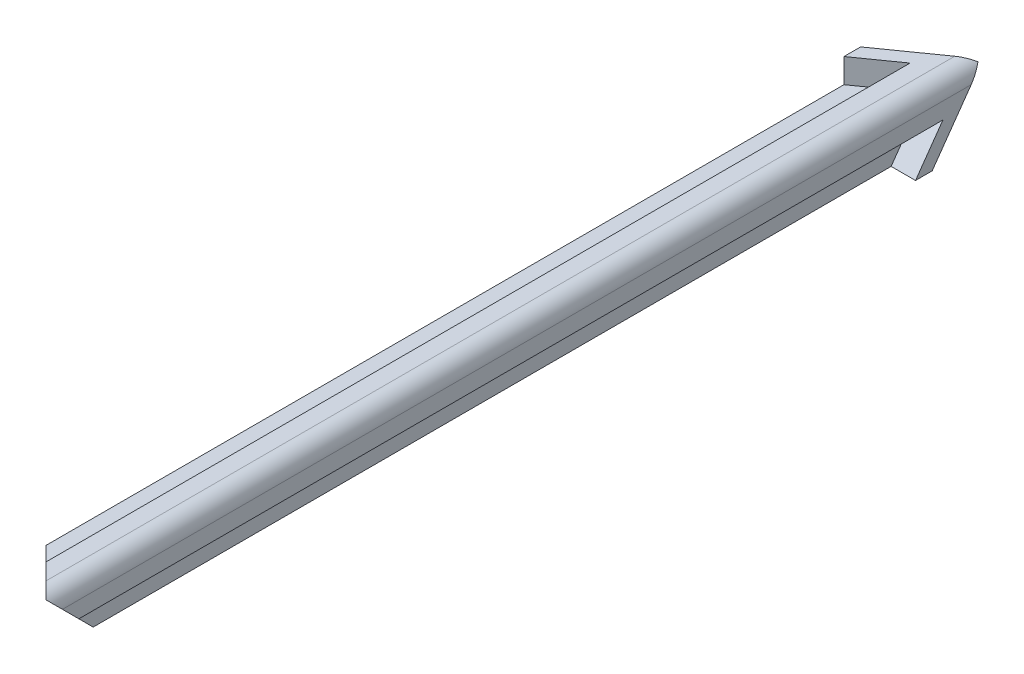
ISO-10303-21;
HEADER;
FILE_DESCRIPTION(('STEP AP214'),'2;1');
FILE_NAME('part.step','',(''),(''),'','','');
FILE_SCHEMA(('AUTOMOTIVE_DESIGN { 1 0 10303 214 1 1 1 1 }'));
ENDSEC;
DATA;
#1=APPLICATION_CONTEXT('core data for automotive mechanical design processes');
#2=APPLICATION_PROTOCOL_DEFINITION('international standard','automotive_design',2000,#1);
#3=PRODUCT_CONTEXT('',#1,'mechanical');
#4=PRODUCT('Part','Part','',(#3));
#5=PRODUCT_RELATED_PRODUCT_CATEGORY('part','',(#4));
#6=PRODUCT_DEFINITION_FORMATION('','',#4);
#7=PRODUCT_DEFINITION_CONTEXT('part definition',#1,'design');
#8=PRODUCT_DEFINITION('design','',#6,#7);
#9=PRODUCT_DEFINITION_SHAPE('','',#8);
#10=(LENGTH_UNIT() NAMED_UNIT(*) SI_UNIT(.MILLI.,.METRE.));
#11=(NAMED_UNIT(*) PLANE_ANGLE_UNIT() SI_UNIT($,.RADIAN.));
#12=(NAMED_UNIT(*) SI_UNIT($,.STERADIAN.) SOLID_ANGLE_UNIT());
#13=UNCERTAINTY_MEASURE_WITH_UNIT(LENGTH_MEASURE(1.E-05),#10,'distance_accuracy_value','');
#14=(GEOMETRIC_REPRESENTATION_CONTEXT(3) GLOBAL_UNCERTAINTY_ASSIGNED_CONTEXT((#13)) GLOBAL_UNIT_ASSIGNED_CONTEXT((#10,
#11,#12)) REPRESENTATION_CONTEXT('',''));
#15=CARTESIAN_POINT('',(0.,0.,0.));
#16=DIRECTION('',(0.,0.,1.));
#17=DIRECTION('',(1.,0.,0.));
#18=AXIS2_PLACEMENT_3D('',#15,#16,#17);
#19=CARTESIAN_POINT('',(-1.50000004800001,-2.53999999999999,130.175));
#20=DIRECTION('',(-1.,0.,0.));
#21=DIRECTION('',(0.,-1.,0.));
#22=AXIS2_PLACEMENT_3D('',#19,#20,#21);
#23=PLANE('',#22);
#24=DIRECTION('',(0.,-0.816496580927727,0.577350269189625));
#25=VECTOR('',#24,1.);
#26=CARTESIAN_POINT('',(-1.50000004800001,-2.53999999999999,4.90690319754844));
#27=LINE('',#26,#25);
#28=CARTESIAN_POINT('',(-1.50000004800001,-2.53999999999999,4.90690319754844));
#29=VERTEX_POINT('',#28);
#30=CARTESIAN_POINT('',(-1.50000004800003,-7.30249999999999,8.27449924294935));
#31=VERTEX_POINT('',#30);
#32=EDGE_CURVE('E189',#29,#31,#27,.T.);
#33=ORIENTED_EDGE('',*,*,#32,.F.);
#34=DIRECTION('',(0.,0.,-1.));
#35=VECTOR('',#34,1.);
#36=CARTESIAN_POINT('',(-1.50000004800001,-2.53999999999999,130.175));
#37=LINE('',#36,#35);
#38=CARTESIAN_POINT('',(-1.50000004800001,-2.53999999999999,111.164878));
#39=VERTEX_POINT('',#38);
#40=EDGE_CURVE('E182',#39,#29,#37,.T.);
#41=ORIENTED_EDGE('',*,*,#40,.F.);
#42=DIRECTION('',(0.,-0.707106781186548,-0.707106781186547));
#43=VECTOR('',#42,1.);
#44=CARTESIAN_POINT('',(-1.50000004799998,6.96506099999999,120.669939));
#45=LINE('',#44,#43);
#46=CARTESIAN_POINT('',(-1.50000004800003,-7.30249999999999,106.402378));
#47=VERTEX_POINT('',#46);
#48=EDGE_CURVE('E290',#39,#47,#45,.T.);
#49=ORIENTED_EDGE('',*,*,#48,.T.);
#50=DIRECTION('',(0.,0.,-1.));
#51=VECTOR('',#50,1.);
#52=CARTESIAN_POINT('',(-1.50000004800003,-7.30249999999999,130.175));
#53=LINE('',#52,#51);
#54=EDGE_CURVE('E58',#47,#31,#53,.T.);
#55=ORIENTED_EDGE('',*,*,#54,.T.);
#56=EDGE_LOOP('',(#33,#41,#49,#55));
#57=FACE_BOUND('',#56,.T.);
#58=ADVANCED_FACE('F39',(#57),#23,.F.);
#59=CARTESIAN_POINT('',(-1.50000004800001,-2.53999999999999,130.175));
#60=DIRECTION('',(0.,1.,0.));
#61=DIRECTION('',(-1.,0.,0.));
#62=AXIS2_PLACEMENT_3D('',#59,#60,#61);
#63=PLANE('',#62);
#64=DIRECTION('',(-1.,0.,0.));
#65=VECTOR('',#64,1.);
#66=CARTESIAN_POINT('',(-1.50000004800001,-2.53999999999999,4.90690319754844));
#67=LINE('',#66,#65);
#68=CARTESIAN_POINT('',(1.50000004799999,-2.54,4.90690319754844));
#69=VERTEX_POINT('',#68);
#70=EDGE_CURVE('E69',#69,#29,#67,.T.);
#71=ORIENTED_EDGE('',*,*,#70,.F.);
#72=DIRECTION('',(0.,0.,-1.));
#73=VECTOR('',#72,1.);
#74=CARTESIAN_POINT('',(1.50000004799999,-2.54,130.175));
#75=LINE('',#74,#73);
#76=CARTESIAN_POINT('',(1.50000004799999,-2.54,111.164878));
#77=VERTEX_POINT('',#76);
#78=EDGE_CURVE('E311',#77,#69,#75,.T.);
#79=ORIENTED_EDGE('',*,*,#78,.F.);
#80=DIRECTION('',(-1.,0.,0.));
#81=VECTOR('',#80,1.);
#82=CARTESIAN_POINT('',(-1.50000004800003,-2.53999999999999,111.164878));
#83=LINE('',#82,#81);
#84=EDGE_CURVE('E184',#77,#39,#83,.T.);
#85=ORIENTED_EDGE('',*,*,#84,.T.);
#86=ORIENTED_EDGE('',*,*,#40,.T.);
#87=EDGE_LOOP('',(#71,#79,#85,#86));
#88=FACE_BOUND('',#87,.T.);
#89=ADVANCED_FACE('F183',(#88),#63,.F.);
#90=CARTESIAN_POINT('',(-7.3025,-1.500000048,130.175));
#91=DIRECTION('',(0.,-1.,0.));
#92=DIRECTION('',(1.,0.,0.));
#93=AXIS2_PLACEMENT_3D('',#90,#91,#92);
#94=PLANE('',#93);
#95=DIRECTION('',(0.816496580927726,0.,-0.577350269189625));
#96=VECTOR('',#95,1.);
#97=CARTESIAN_POINT('',(-7.30249999999999,-1.500000048,8.27449924294937));
#98=LINE('',#97,#96);
#99=CARTESIAN_POINT('',(-7.3025,-1.500000048,8.27449924294937));
#100=VERTEX_POINT('',#99);
#101=CARTESIAN_POINT('',(-2.54,-1.500000048,4.90690319754844));
#102=VERTEX_POINT('',#101);
#103=EDGE_CURVE('E210',#100,#102,#98,.T.);
#104=ORIENTED_EDGE('',*,*,#103,.F.);
#105=DIRECTION('',(0.,0.,-1.));
#106=VECTOR('',#105,1.);
#107=CARTESIAN_POINT('',(-7.3025,-1.500000048,130.175));
#108=LINE('',#107,#106);
#109=CARTESIAN_POINT('',(-7.3025,-1.500000048,106.402378));
#110=VERTEX_POINT('',#109);
#111=EDGE_CURVE('E330',#110,#100,#108,.T.);
#112=ORIENTED_EDGE('',*,*,#111,.F.);
#113=DIRECTION('',(0.707106781186548,0.,0.707106781186547));
#114=VECTOR('',#113,1.);
#115=CARTESIAN_POINT('',(4.58381100000001,-1.500000048,118.288689));
#116=LINE('',#115,#114);
#117=CARTESIAN_POINT('',(-2.54,-1.500000048,111.164878));
#118=VERTEX_POINT('',#117);
#119=EDGE_CURVE('E266',#110,#118,#116,.T.);
#120=ORIENTED_EDGE('',*,*,#119,.T.);
#121=DIRECTION('',(0.,0.,-1.));
#122=VECTOR('',#121,1.);
#123=CARTESIAN_POINT('',(-2.54,-1.500000048,130.175));
#124=LINE('',#123,#122);
#125=EDGE_CURVE('E334',#118,#102,#124,.T.);
#126=ORIENTED_EDGE('',*,*,#125,.T.);
#127=EDGE_LOOP('',(#104,#112,#120,#126));
#128=FACE_BOUND('',#127,.T.);
#129=ADVANCED_FACE('F398',(#128),#94,.F.);
#130=CARTESIAN_POINT('',(-2.54,1.500000048,130.175));
#131=DIRECTION('',(1.,0.,0.));
#132=DIRECTION('',(0.,0.,-1.));
#133=AXIS2_PLACEMENT_3D('',#130,#131,#132);
#134=PLANE('',#133);
#135=DIRECTION('',(0.,1.,0.));
#136=VECTOR('',#135,1.);
#137=CARTESIAN_POINT('',(-2.54,1.49999999999995,4.90690319754843));
#138=LINE('',#137,#136);
#139=CARTESIAN_POINT('',(-2.54,1.49999999999995,4.90690319754843));
#140=VERTEX_POINT('',#139);
#141=EDGE_CURVE('E214',#102,#140,#138,.T.);
#142=ORIENTED_EDGE('',*,*,#141,.F.);
#143=ORIENTED_EDGE('',*,*,#125,.F.);
#144=DIRECTION('',(0.,1.,0.));
#145=VECTOR('',#144,1.);
#146=CARTESIAN_POINT('',(-2.54,1.50000004799998,111.164878));
#147=LINE('',#146,#145);
#148=CARTESIAN_POINT('',(-2.54,1.500000048,111.164878));
#149=VERTEX_POINT('',#148);
#150=EDGE_CURVE('E270',#118,#149,#147,.T.);
#151=ORIENTED_EDGE('',*,*,#150,.T.);
#152=DIRECTION('',(0.,0.,-1.));
#153=VECTOR('',#152,1.);
#154=CARTESIAN_POINT('',(-2.54,1.500000048,130.175));
#155=LINE('',#154,#153);
#156=EDGE_CURVE('E186',#149,#140,#155,.T.);
#157=ORIENTED_EDGE('',*,*,#156,.T.);
#158=EDGE_LOOP('',(#142,#143,#151,#157));
#159=FACE_BOUND('',#158,.T.);
#160=ADVANCED_FACE('F403',(#159),#134,.F.);
#161=CARTESIAN_POINT('',(-7.3025,-3.621225168,130.175));
#162=DIRECTION('',(0.,1.,0.));
#163=DIRECTION('',(0.,0.,1.));
#164=AXIS2_PLACEMENT_3D('',#161,#162,#163);
#165=PLANE('',#164);
#166=DIRECTION('',(-0.816496580927726,0.,0.577350269189625));
#167=VECTOR('',#166,1.);
#168=CARTESIAN_POINT('',(-67.4404918833059,-3.621225168,45.1270362647456));
#169=LINE('',#168,#167);
#170=CARTESIAN_POINT('',(-5.8662891982673,-3.62122516800001,1.58749999999995));
#171=VERTEX_POINT('',#170);
#172=CARTESIAN_POINT('',(-7.3025,-3.621225168,2.60305439711853));
#173=VERTEX_POINT('',#172);
#174=EDGE_CURVE('E243',#171,#173,#169,.T.);
#175=ORIENTED_EDGE('',*,*,#174,.F.);
#176=DIRECTION('',(0.,0.,-1.));
#177=VECTOR('',#176,1.);
#178=CARTESIAN_POINT('',(-5.8662891982673,-3.621225168,130.175));
#179=LINE('',#178,#177);
#180=CARTESIAN_POINT('',(-5.8662891982673,-3.621225168,107.838588801733));
#181=VERTEX_POINT('',#180);
#182=EDGE_CURVE('E318',#181,#171,#179,.T.);
#183=ORIENTED_EDGE('',*,*,#182,.F.);
#184=DIRECTION('',(-0.707106781186548,0.,-0.707106781186547));
#185=VECTOR('',#184,1.);
#186=CARTESIAN_POINT('',(4.58381100000001,-3.621225168,118.288689));
#187=LINE('',#186,#185);
#188=CARTESIAN_POINT('',(-7.3025,-3.621225168,106.402378));
#189=VERTEX_POINT('',#188);
#190=EDGE_CURVE('E258',#181,#189,#187,.T.);
#191=ORIENTED_EDGE('',*,*,#190,.T.);
#192=DIRECTION('',(0.,0.,-1.));
#193=VECTOR('',#192,1.);
#194=CARTESIAN_POINT('',(-7.3025,-3.621225168,130.175));
#195=LINE('',#194,#193);
#196=EDGE_CURVE('E338',#189,#173,#195,.T.);
#197=ORIENTED_EDGE('',*,*,#196,.T.);
#198=EDGE_LOOP('',(#175,#183,#191,#197));
#199=FACE_BOUND('',#198,.T.);
#200=ADVANCED_FACE('F366',(#199),#165,.F.);
#201=CARTESIAN_POINT('',(-3.62122516800001,-2.53999999999999,130.175));
#202=DIRECTION('',(1.,0.,0.));
#203=DIRECTION('',(0.,1.,0.));
#204=AXIS2_PLACEMENT_3D('',#201,#202,#203);
#205=PLANE('',#204);
#206=DIRECTION('',(0.,0.816496580927727,-0.577350269189625));
#207=VECTOR('',#206,1.);
#208=CARTESIAN_POINT('',(-3.62122516800022,-64.2654918833058,42.8819722344782));
#209=LINE('',#208,#207);
#210=CARTESIAN_POINT('',(-3.62122516800002,-7.30249999999998,2.60305439711855));
#211=VERTEX_POINT('',#210);
#212=CARTESIAN_POINT('',(-3.62122516800002,-5.86628919826728,1.58749999999998));
#213=VERTEX_POINT('',#212);
#214=EDGE_CURVE('E232',#211,#213,#209,.T.);
#215=ORIENTED_EDGE('',*,*,#214,.F.);
#216=DIRECTION('',(0.,0.,-1.));
#217=VECTOR('',#216,1.);
#218=CARTESIAN_POINT('',(-3.62122516800002,-7.30249999999999,130.175));
#219=LINE('',#218,#217);
#220=CARTESIAN_POINT('',(-3.62122516800002,-7.30249999999999,106.402378));
#221=VERTEX_POINT('',#220);
#222=EDGE_CURVE('E326',#221,#211,#219,.T.);
#223=ORIENTED_EDGE('',*,*,#222,.F.);
#224=DIRECTION('',(0.,0.707106781186548,0.707106781186547));
#225=VECTOR('',#224,1.);
#226=CARTESIAN_POINT('',(-3.62122516799998,6.96506099999999,120.669939));
#227=LINE('',#226,#225);
#228=CARTESIAN_POINT('',(-3.62122516800001,-5.86628919826729,107.838588801733));
#229=VERTEX_POINT('',#228);
#230=EDGE_CURVE('E282',#221,#229,#227,.T.);
#231=ORIENTED_EDGE('',*,*,#230,.T.);
#232=DIRECTION('',(0.,0.,-1.));
#233=VECTOR('',#232,1.);
#234=CARTESIAN_POINT('',(-3.62122516800001,-5.86628919826729,130.175));
#235=LINE('',#234,#233);
#236=EDGE_CURVE('E314',#229,#213,#235,.T.);
#237=ORIENTED_EDGE('',*,*,#236,.T.);
#238=EDGE_LOOP('',(#215,#223,#231,#237));
#239=FACE_BOUND('',#238,.T.);
#240=ADVANCED_FACE('F390',(#239),#205,.F.);
#241=CARTESIAN_POINT('',(-7.3025,-1.500000048,130.175));
#242=DIRECTION('',(1.,0.,0.));
#243=DIRECTION('',(0.,0.,-1.));
#244=AXIS2_PLACEMENT_3D('',#241,#242,#243);
#245=PLANE('',#244);
#246=DIRECTION('',(0.,0.816496580927726,0.577350269189626));
#247=VECTOR('',#246,1.);
#248=CARTESIAN_POINT('',(-7.3025,57.9309167953059,46.1269913759293));
#249=LINE('',#248,#247);
#250=CARTESIAN_POINT('',(-7.30249999999999,1.50000004800001,6.22430747533568));
#251=VERTEX_POINT('',#250);
#252=EDGE_CURVE('E246',#173,#251,#249,.T.);
#253=ORIENTED_EDGE('',*,*,#252,.F.);
#254=ORIENTED_EDGE('',*,*,#196,.F.);
#255=DIRECTION('',(0.,1.,0.));
#256=VECTOR('',#255,1.);
#257=CARTESIAN_POINT('',(-7.3025,-1.50000004800002,106.402378));
#258=LINE('',#257,#256);
#259=EDGE_CURVE('E262',#189,#110,#258,.T.);
#260=ORIENTED_EDGE('',*,*,#259,.T.);
#261=ORIENTED_EDGE('',*,*,#111,.T.);
#262=DIRECTION('',(0.,1.,0.));
#263=VECTOR('',#262,1.);
#264=CARTESIAN_POINT('',(-7.30249999999999,1.49999999999995,8.27449924294936));
#265=LINE('',#264,#263);
#266=CARTESIAN_POINT('',(-7.30249999999999,1.49999999999995,8.27449924294936));
#267=VERTEX_POINT('',#266);
#268=EDGE_CURVE('E209',#100,#267,#265,.T.);
#269=ORIENTED_EDGE('',*,*,#268,.T.);
#270=DIRECTION('',(0.,2.34124743921473E-08,-1.));
#271=VECTOR('',#270,1.);
#272=CARTESIAN_POINT('',(-7.30249999999999,1.50000004800001,6.22430747533568));
#273=LINE('',#272,#271);
#274=EDGE_CURVE('E215',#267,#251,#273,.T.);
#275=ORIENTED_EDGE('',*,*,#274,.T.);
#276=EDGE_LOOP('',(#253,#254,#260,#261,#269,#275));
#277=FACE_BOUND('',#276,.T.);
#278=ADVANCED_FACE('F41',(#277),#245,.F.);
#279=CARTESIAN_POINT('',(-1.50000004800003,-7.30249999999999,130.175));
#280=DIRECTION('',(0.,1.,0.));
#281=DIRECTION('',(-1.,0.,0.));
#282=AXIS2_PLACEMENT_3D('',#279,#280,#281);
#283=PLANE('',#282);
#284=DIRECTION('',(-0.816496580927726,0.,-0.577350269189626));
#285=VECTOR('',#284,1.);
#286=CARTESIAN_POINT('',(57.9309167953059,-7.30250000000019,46.1269913759292));
#287=LINE('',#286,#285);
#288=CARTESIAN_POINT('',(1.50000004799998,-7.30250000000001,6.22430747533571));
#289=VERTEX_POINT('',#288);
#290=EDGE_CURVE('E235',#289,#211,#287,.T.);
#291=ORIENTED_EDGE('',*,*,#290,.F.);
#292=DIRECTION('',(0.,0.,1.));
#293=VECTOR('',#292,1.);
#294=CARTESIAN_POINT('',(1.50000004799998,-7.30250000000001,8.27449924294937));
#295=LINE('',#294,#293);
#296=CARTESIAN_POINT('',(1.50000004799998,-7.30250000000001,8.27449924294937));
#297=VERTEX_POINT('',#296);
#298=EDGE_CURVE('E193',#289,#297,#295,.T.);
#299=ORIENTED_EDGE('',*,*,#298,.T.);
#300=DIRECTION('',(-1.,0.,0.));
#301=VECTOR('',#300,1.);
#302=CARTESIAN_POINT('',(-1.50000004800003,-7.3025,8.27449924294937));
#303=LINE('',#302,#301);
#304=EDGE_CURVE('E206',#297,#31,#303,.T.);
#305=ORIENTED_EDGE('',*,*,#304,.T.);
#306=ORIENTED_EDGE('',*,*,#54,.F.);
#307=DIRECTION('',(-1.,0.,0.));
#308=VECTOR('',#307,1.);
#309=CARTESIAN_POINT('',(-1.50000004800006,-7.30249999999999,106.402378));
#310=LINE('',#309,#308);
#311=EDGE_CURVE('E286',#47,#221,#310,.T.);
#312=ORIENTED_EDGE('',*,*,#311,.T.);
#313=ORIENTED_EDGE('',*,*,#222,.T.);
#314=EDGE_LOOP('',(#291,#299,#305,#306,#312,#313));
#315=FACE_BOUND('',#314,.T.);
#316=ADVANCED_FACE('F387',(#315),#283,.F.);
#317=CARTESIAN_POINT('',(-0.519999976000003,-0.519999975999996,130.175));
#318=DIRECTION('',(0.,0.,-1.));
#319=DIRECTION('',(-1.,0.,0.));
#320=AXIS2_PLACEMENT_3D('',#317,#318,#319);
#321=CYLINDRICAL_SURFACE('',#320,2.020000024);
#322=CARTESIAN_POINT('',(-0.519999976000003,-0.519999975999996,0.));
#323=DIRECTION('',(-0.499999999999999,0.500000000000001,-0.707106781186548));
#324=DIRECTION('',(0.5,-0.500000000000001,-0.707106781186548));
#325=AXIS2_PLACEMENT_3D('',#322,#323,#324);
#326=ELLIPSE('',#325,2.85671142993477,2.020000024);
#327=CARTESIAN_POINT('',(-0.519999975999996,1.500000048,1.42835571496734));
#328=VERTEX_POINT('',#327);
#329=CARTESIAN_POINT('',(0.90835573896739,0.908355738967382,0.));
#330=VERTEX_POINT('',#329);
#331=EDGE_CURVE('E252',#328,#330,#326,.T.);
#332=ORIENTED_EDGE('',*,*,#331,.F.);
#333=DIRECTION('',(0.,0.,-1.));
#334=VECTOR('',#333,1.);
#335=CARTESIAN_POINT('',(-0.519999976000003,1.500000048,130.175));
#336=LINE('',#335,#334);
#337=CARTESIAN_POINT('',(-0.519999976000003,1.500000048,113.184878024));
#338=VERTEX_POINT('',#337);
#339=EDGE_CURVE('E303',#338,#328,#336,.T.);
#340=ORIENTED_EDGE('',*,*,#339,.F.);
#341=CARTESIAN_POINT('',(-0.519999976000003,-0.519999975999996,113.184878024));
#342=DIRECTION('',(0.707106781186547,0.,-0.707106781186548));
#343=DIRECTION('',(-0.707106781186548,0.,-0.707106781186547));
#344=AXIS2_PLACEMENT_3D('',#341,#342,#343);
#345=ELLIPSE('',#344,2.85671142993477,2.020000024);
#346=CARTESIAN_POINT('',(0.908355738967413,0.908355738967354,114.613233738967));
#347=VERTEX_POINT('',#346);
#348=EDGE_CURVE('E278',#338,#347,#345,.T.);
#349=ORIENTED_EDGE('',*,*,#348,.T.);
#350=CARTESIAN_POINT('',(-0.519999976000003,-0.519999975999996,113.184878024));
#351=DIRECTION('',(0.,0.707106781186547,-0.707106781186548));
#352=DIRECTION('',(0.,-0.707106781186548,-0.707106781186547));
#353=AXIS2_PLACEMENT_3D('',#350,#351,#352);
#354=ELLIPSE('',#353,2.85671142993477,2.020000024);
#355=CARTESIAN_POINT('',(1.50000004799999,-0.519999975999995,113.184878024));
#356=VERTEX_POINT('',#355);
#357=EDGE_CURVE('E299',#347,#356,#354,.T.);
#358=ORIENTED_EDGE('',*,*,#357,.T.);
#359=DIRECTION('',(0.,0.,-1.));
#360=VECTOR('',#359,1.);
#361=CARTESIAN_POINT('',(1.50000004799999,-0.519999975999996,130.175));
#362=LINE('',#361,#360);
#363=CARTESIAN_POINT('',(1.50000004799999,-0.519999975999989,1.42835571496737));
#364=VERTEX_POINT('',#363);
#365=EDGE_CURVE('E307',#356,#364,#362,.T.);
#366=ORIENTED_EDGE('',*,*,#365,.T.);
#367=CARTESIAN_POINT('',(-0.519999976000003,-0.519999975999996,0.));
#368=DIRECTION('',(0.499999999999999,-0.5,-0.707106781186548));
#369=DIRECTION('',(-0.5,0.500000000000001,-0.707106781186547));
#370=AXIS2_PLACEMENT_3D('',#367,#368,#369);
#371=ELLIPSE('',#370,2.85671142993477,2.020000024);
#372=EDGE_CURVE('E241',#330,#364,#371,.T.);
#373=ORIENTED_EDGE('',*,*,#372,.F.);
#374=EDGE_LOOP('',(#332,#340,#349,#358,#366,#373));
#375=FACE_BOUND('',#374,.T.);
#376=ADVANCED_FACE('F378',(#375),#321,.T.);
#377=CARTESIAN_POINT('',(1.50000004799999,-2.54,130.175));
#378=DIRECTION('',(-1.,0.,0.));
#379=DIRECTION('',(0.,0.,1.));
#380=AXIS2_PLACEMENT_3D('',#377,#378,#379);
#381=PLANE('',#380);
#382=DIRECTION('',(0.,-0.816496580927726,0.577350269189626));
#383=VECTOR('',#382,1.);
#384=CARTESIAN_POINT('',(1.50000004799999,-62.5584168113059,45.2961409532899));
#385=LINE('',#384,#383);
#386=EDGE_CURVE('E237',#364,#289,#385,.T.);
#387=ORIENTED_EDGE('',*,*,#386,.F.);
#388=ORIENTED_EDGE('',*,*,#365,.F.);
#389=DIRECTION('',(0.,-0.707106781186548,-0.707106781186547));
#390=VECTOR('',#389,1.);
#391=CARTESIAN_POINT('',(1.50000004799999,6.96506099999998,120.669939));
#392=LINE('',#391,#390);
#393=EDGE_CURVE('E295',#356,#77,#392,.T.);
#394=ORIENTED_EDGE('',*,*,#393,.T.);
#395=ORIENTED_EDGE('',*,*,#78,.T.);
#396=DIRECTION('',(0.,-0.816496580927727,0.577350269189625));
#397=VECTOR('',#396,1.);
#398=CARTESIAN_POINT('',(1.50000004799999,-2.54,4.90690319754844));
#399=LINE('',#398,#397);
#400=EDGE_CURVE('E198',#69,#297,#399,.T.);
#401=ORIENTED_EDGE('',*,*,#400,.T.);
#402=ORIENTED_EDGE('',*,*,#298,.F.);
#403=EDGE_LOOP('',(#387,#388,#394,#395,#401,#402));
#404=FACE_BOUND('',#403,.T.);
#405=ADVANCED_FACE('F383',(#404),#381,.F.);
#406=CARTESIAN_POINT('',(-2.54,1.500000048,130.175));
#407=DIRECTION('',(0.,-1.,0.));
#408=DIRECTION('',(0.,0.,-1.));
#409=AXIS2_PLACEMENT_3D('',#406,#407,#408);
#410=PLANE('',#409);
#411=DIRECTION('',(0.816496580927726,0.,-0.577350269189625));
#412=VECTOR('',#411,1.);
#413=CARTESIAN_POINT('',(-62.5584168113059,1.500000048,45.2961409532897));
#414=LINE('',#413,#412);
#415=EDGE_CURVE('E249',#251,#328,#414,.T.);
#416=ORIENTED_EDGE('',*,*,#415,.F.);
#417=ORIENTED_EDGE('',*,*,#274,.F.);
#418=DIRECTION('',(0.816496580927726,0.,-0.577350269189625));
#419=VECTOR('',#418,1.);
#420=CARTESIAN_POINT('',(-7.30249999999999,1.49999999999995,8.27449924294936));
#421=LINE('',#420,#419);
#422=EDGE_CURVE('E221',#267,#140,#421,.T.);
#423=ORIENTED_EDGE('',*,*,#422,.T.);
#424=ORIENTED_EDGE('',*,*,#156,.F.);
#425=DIRECTION('',(0.707106781186548,0.,0.707106781186547));
#426=VECTOR('',#425,1.);
#427=CARTESIAN_POINT('',(6.96506100000001,1.500000048,120.669939));
#428=LINE('',#427,#426);
#429=EDGE_CURVE('E274',#149,#338,#428,.T.);
#430=ORIENTED_EDGE('',*,*,#429,.T.);
#431=ORIENTED_EDGE('',*,*,#339,.T.);
#432=EDGE_LOOP('',(#416,#417,#423,#424,#430,#431));
#433=FACE_BOUND('',#432,.T.);
#434=ADVANCED_FACE('F374',(#433),#410,.F.);
#435=CARTESIAN_POINT('',(-5.8662891982673,-3.621225168,130.175));
#436=DIRECTION('',(0.707106781186548,0.707106781186547,0.));
#437=DIRECTION('',(-0.707106781186547,0.707106781186548,0.));
#438=AXIS2_PLACEMENT_3D('',#435,#436,#437);
#439=PLANE('',#438);
#440=DIRECTION('',(-0.5,0.5,0.707106781186547));
#441=VECTOR('',#440,1.);
#442=CARTESIAN_POINT('',(-51.3288358111799,41.8413214449126,65.88125));
#443=LINE('',#442,#441);
#444=CARTESIAN_POINT('',(-4.74375718313366,-4.74375718313365,0.));
#445=VERTEX_POINT('',#444);
#446=EDGE_CURVE('E11',#445,#171,#443,.T.);
#447=ORIENTED_EDGE('',*,*,#446,.F.);
#448=DIRECTION('',(-0.5,0.5,-0.707106781186547));
#449=VECTOR('',#448,1.);
#450=CARTESIAN_POINT('',(40.7187894297789,-50.2063037960462,64.2937499999999));
#451=LINE('',#450,#449);
#452=EDGE_CURVE('E48',#213,#445,#451,.T.);
#453=ORIENTED_EDGE('',*,*,#452,.F.);
#454=ORIENTED_EDGE('',*,*,#236,.F.);
#455=DIRECTION('',(-0.577350269189626,0.577350269189626,0.577350269189625));
#456=VECTOR('',#455,1.);
#457=CARTESIAN_POINT('',(-12.5634049209339,3.07589055466666,116.780768554667));
#458=LINE('',#457,#456);
#459=CARTESIAN_POINT('',(-4.74375718313363,-4.74375718313367,108.961120816866));
#460=VERTEX_POINT('',#459);
#461=EDGE_CURVE('E346',#229,#460,#458,.T.);
#462=ORIENTED_EDGE('',*,*,#461,.T.);
#463=DIRECTION('',(-0.577350269189625,0.577350269189626,-0.577350269189626));
#464=VECTOR('',#463,1.);
#465=CARTESIAN_POINT('',(1.57918120115514,-11.0666955674224,115.284059201155));
#466=LINE('',#465,#464);
#467=EDGE_CURVE('E342',#460,#181,#466,.T.);
#468=ORIENTED_EDGE('',*,*,#467,.T.);
#469=ORIENTED_EDGE('',*,*,#182,.T.);
#470=EDGE_LOOP('',(#447,#453,#454,#462,#468,#469));
#471=FACE_BOUND('',#470,.T.);
#472=ADVANCED_FACE('F363',(#471),#439,.F.);
#473=CARTESIAN_POINT('',(66.3584148391277,-23.444146371564,90.2607316284362));
#474=DIRECTION('',(0.,0.707106781186547,-0.707106781186548));
#475=DIRECTION('',(0.,0.707106781186548,0.707106781186547));
#476=AXIS2_PLACEMENT_3D('',#473,#474,#475);
#477=PLANE('',#476);
#478=DIRECTION('',(-0.577350269189627,-0.577350269189625,-0.577350269189626));
#479=VECTOR('',#478,1.);
#480=CARTESIAN_POINT('',(6.4900406986667,6.49004069866663,120.194918698667));
#481=LINE('',#480,#479);
#482=EDGE_CURVE('E254',#347,#460,#481,.T.);
#483=ORIENTED_EDGE('',*,*,#482,.T.);
#484=ORIENTED_EDGE('',*,*,#461,.F.);
#485=ORIENTED_EDGE('',*,*,#230,.F.);
#486=ORIENTED_EDGE('',*,*,#311,.F.);
#487=ORIENTED_EDGE('',*,*,#48,.F.);
#488=ORIENTED_EDGE('',*,*,#84,.F.);
#489=ORIENTED_EDGE('',*,*,#393,.F.);
#490=ORIENTED_EDGE('',*,*,#357,.F.);
#491=EDGE_LOOP('',(#483,#484,#485,#486,#487,#488,#489,#490));
#492=FACE_BOUND('',#491,.T.);
#493=ADVANCED_FACE('F392',(#492),#477,.F.);
#494=CARTESIAN_POINT('',(6.4900406986667,6.49004069866663,120.194918698667));
#495=DIRECTION('',(0.707106781186547,0.,-0.707106781186548));
#496=DIRECTION('',(-0.707106781186548,0.,-0.707106781186547));
#497=AXIS2_PLACEMENT_3D('',#494,#495,#496);
#498=PLANE('',#497);
#499=ORIENTED_EDGE('',*,*,#429,.F.);
#500=ORIENTED_EDGE('',*,*,#150,.F.);
#501=ORIENTED_EDGE('',*,*,#119,.F.);
#502=ORIENTED_EDGE('',*,*,#259,.F.);
#503=ORIENTED_EDGE('',*,*,#190,.F.);
#504=ORIENTED_EDGE('',*,*,#467,.F.);
#505=ORIENTED_EDGE('',*,*,#482,.F.);
#506=ORIENTED_EDGE('',*,*,#348,.F.);
#507=EDGE_LOOP('',(#499,#500,#501,#502,#503,#504,#505,#506));
#508=FACE_BOUND('',#507,.T.);
#509=ADVANCED_FACE('F395',(#508),#498,.F.);
#510=CARTESIAN_POINT('',(-186.907622421383,172.302622421383,254.));
#511=DIRECTION('',(-0.499999999999999,0.500000000000001,-0.707106781186548));
#512=DIRECTION('',(0.,0.816496580927726,0.577350269189626));
#513=AXIS2_PLACEMENT_3D('',#510,#511,#512);
#514=PLANE('',#513);
#515=ORIENTED_EDGE('',*,*,#331,.T.);
#516=DIRECTION('',(-0.707106781186548,-0.707106781186547,0.));
#517=VECTOR('',#516,1.);
#518=CARTESIAN_POINT('',(-7.30249999999999,-7.30249999999998,0.));
#519=LINE('',#518,#517);
#520=EDGE_CURVE('E225',#330,#445,#519,.T.);
#521=ORIENTED_EDGE('',*,*,#520,.T.);
#522=ORIENTED_EDGE('',*,*,#446,.T.);
#523=ORIENTED_EDGE('',*,*,#174,.T.);
#524=ORIENTED_EDGE('',*,*,#252,.T.);
#525=ORIENTED_EDGE('',*,*,#415,.T.);
#526=EDGE_LOOP('',(#515,#521,#522,#523,#524,#525));
#527=FACE_BOUND('',#526,.T.);
#528=ADVANCED_FACE('F360',(#527),#514,.T.);
#529=CARTESIAN_POINT('',(-7.30249999999999,-7.30249999999998,0.));
#530=DIRECTION('',(0.499999999999999,-0.5,-0.707106781186548));
#531=DIRECTION('',(0.,0.816496580927726,-0.577350269189626));
#532=AXIS2_PLACEMENT_3D('',#529,#530,#531);
#533=PLANE('',#532);
#534=ORIENTED_EDGE('',*,*,#386,.T.);
#535=ORIENTED_EDGE('',*,*,#290,.T.);
#536=ORIENTED_EDGE('',*,*,#214,.T.);
#537=ORIENTED_EDGE('',*,*,#452,.T.);
#538=ORIENTED_EDGE('',*,*,#520,.F.);
#539=ORIENTED_EDGE('',*,*,#372,.T.);
#540=EDGE_LOOP('',(#534,#535,#536,#537,#538,#539));
#541=FACE_BOUND('',#540,.T.);
#542=ADVANCED_FACE('F353',(#541),#533,.T.);
#543=CARTESIAN_POINT('',(-7.30249999999999,1.49999999999995,8.27449924294936));
#544=DIRECTION('',(-0.577350269189625,0.,-0.816496580927726));
#545=DIRECTION('',(-0.816496580927726,0.,0.577350269189625));
#546=AXIS2_PLACEMENT_3D('',#543,#544,#545);
#547=PLANE('',#546);
#548=ORIENTED_EDGE('',*,*,#422,.F.);
#549=ORIENTED_EDGE('',*,*,#268,.F.);
#550=ORIENTED_EDGE('',*,*,#103,.T.);
#551=ORIENTED_EDGE('',*,*,#141,.T.);
#552=EDGE_LOOP('',(#548,#549,#550,#551));
#553=FACE_BOUND('',#552,.T.);
#554=ADVANCED_FACE('F401',(#553),#547,.F.);
#555=CARTESIAN_POINT('',(-1.50000004800001,-2.53999999999999,4.90690319754844));
#556=DIRECTION('',(0.,0.577350269189625,0.816496580927727));
#557=DIRECTION('',(0.,-0.816496580927727,0.577350269189625));
#558=AXIS2_PLACEMENT_3D('',#555,#556,#557);
#559=PLANE('',#558);
#560=ORIENTED_EDGE('',*,*,#304,.F.);
#561=ORIENTED_EDGE('',*,*,#400,.F.);
#562=ORIENTED_EDGE('',*,*,#70,.T.);
#563=ORIENTED_EDGE('',*,*,#32,.T.);
#564=EDGE_LOOP('',(#560,#561,#562,#563));
#565=FACE_BOUND('',#564,.T.);
#566=ADVANCED_FACE('F196',(#565),#559,.T.);
#567=CLOSED_SHELL('',(#58,#89,#129,#160,#200,#240,#278,#316,#376,#405,#434,#472,#493,#509,#528,
#542,#554,#566));
#568=MANIFOLD_SOLID_BREP('B2',#567);
#569=ADVANCED_BREP_SHAPE_REPRESENTATION('',(#18,#568),#14);
#570=SHAPE_DEFINITION_REPRESENTATION(#9,#569);
ENDSEC;
END-ISO-10303-21;
